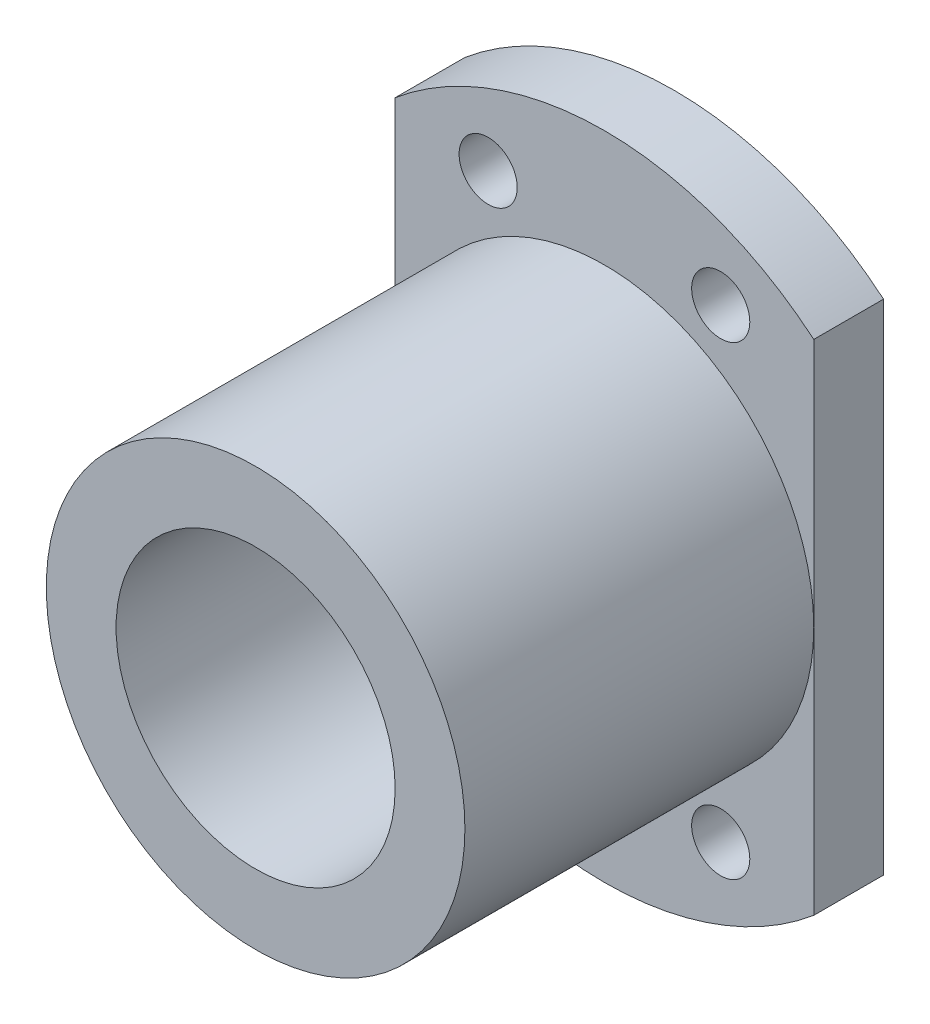
ISO-10303-21;
HEADER;
FILE_DESCRIPTION(('STEP AP214'),'2;1');
FILE_NAME('part.step','',(''),(''),'','','');
FILE_SCHEMA(('AUTOMOTIVE_DESIGN { 1 0 10303 214 1 1 1 1 }'));
ENDSEC;
DATA;
#1=APPLICATION_CONTEXT('core data for automotive mechanical design processes');
#2=APPLICATION_PROTOCOL_DEFINITION('international standard','automotive_design',2000,#1);
#3=PRODUCT_CONTEXT('',#1,'mechanical');
#4=PRODUCT('Part','Part','',(#3));
#5=PRODUCT_RELATED_PRODUCT_CATEGORY('part','',(#4));
#6=PRODUCT_DEFINITION_FORMATION('','',#4);
#7=PRODUCT_DEFINITION_CONTEXT('part definition',#1,'design');
#8=PRODUCT_DEFINITION('design','',#6,#7);
#9=PRODUCT_DEFINITION_SHAPE('','',#8);
#10=(LENGTH_UNIT() NAMED_UNIT(*) SI_UNIT(.MILLI.,.METRE.));
#11=(NAMED_UNIT(*) PLANE_ANGLE_UNIT() SI_UNIT($,.RADIAN.));
#12=(NAMED_UNIT(*) SI_UNIT($,.STERADIAN.) SOLID_ANGLE_UNIT());
#13=UNCERTAINTY_MEASURE_WITH_UNIT(LENGTH_MEASURE(1.E-05),#10,'distance_accuracy_value','');
#14=(GEOMETRIC_REPRESENTATION_CONTEXT(3) GLOBAL_UNCERTAINTY_ASSIGNED_CONTEXT((#13)) GLOBAL_UNIT_ASSIGNED_CONTEXT((#10,
#11,#12)) REPRESENTATION_CONTEXT('',''));
#15=CARTESIAN_POINT('',(0.,0.,0.));
#16=DIRECTION('',(0.,0.,1.));
#17=DIRECTION('',(1.,0.,0.));
#18=AXIS2_PLACEMENT_3D('',#15,#16,#17);
#19=CARTESIAN_POINT('',(0.,0.,3.));
#20=DIRECTION('',(0.,0.,1.));
#21=DIRECTION('',(1.,0.,0.));
#22=AXIS2_PLACEMENT_3D('',#19,#20,#21);
#23=PLANE('',#22);
#24=CARTESIAN_POINT('',(0.,0.,3.));
#25=DIRECTION('',(0.,0.,1.));
#26=DIRECTION('',(1.,0.,0.));
#27=AXIS2_PLACEMENT_3D('',#24,#25,#26);
#28=CIRCLE('',#27,9.);
#29=CARTESIAN_POINT('',(9.,0.,3.));
#30=VERTEX_POINT('',#29);
#31=CARTESIAN_POINT('',(-9.,0.,3.));
#32=VERTEX_POINT('',#31);
#33=EDGE_CURVE('E42',#30,#32,#28,.T.);
#34=ORIENTED_EDGE('',*,*,#33,.F.);
#35=DIRECTION('',(0.,1.,0.));
#36=VECTOR('',#35,1.);
#37=CARTESIAN_POINT('',(9.,10.7238052947636,3.));
#38=LINE('',#37,#36);
#39=CARTESIAN_POINT('',(9.,10.7238052947636,3.));
#40=VERTEX_POINT('',#39);
#41=EDGE_CURVE('E56',#30,#40,#38,.T.);
#42=ORIENTED_EDGE('',*,*,#41,.T.);
#43=CARTESIAN_POINT('',(0.,0.,3.));
#44=DIRECTION('',(0.,0.,1.));
#45=DIRECTION('',(1.,0.,0.));
#46=AXIS2_PLACEMENT_3D('',#43,#44,#45);
#47=CIRCLE('',#46,14.);
#48=CARTESIAN_POINT('',(-9.,10.7238052947636,3.));
#49=VERTEX_POINT('',#48);
#50=EDGE_CURVE('E154',#40,#49,#47,.T.);
#51=ORIENTED_EDGE('',*,*,#50,.T.);
#52=DIRECTION('',(0.,-1.,0.));
#53=VECTOR('',#52,1.);
#54=CARTESIAN_POINT('',(-9.,10.7238052947636,3.));
#55=LINE('',#54,#53);
#56=EDGE_CURVE('E85',#49,#32,#55,.T.);
#57=ORIENTED_EDGE('',*,*,#56,.T.);
#58=EDGE_LOOP('',(#34,#42,#51,#57));
#59=FACE_BOUND('',#58,.T.);
#60=CARTESIAN_POINT('',(5.,10.,3.));
#61=DIRECTION('',(0.,0.,1.));
#62=DIRECTION('',(1.,0.,0.));
#63=AXIS2_PLACEMENT_3D('',#60,#61,#62);
#64=CIRCLE('',#63,1.25);
#65=CARTESIAN_POINT('',(6.25,10.,3.));
#66=VERTEX_POINT('',#65);
#67=EDGE_CURVE('E171',#66,#66,#64,.T.);
#68=ORIENTED_EDGE('',*,*,#67,.F.);
#69=EDGE_LOOP('',(#68));
#70=FACE_BOUND('',#69,.T.);
#71=CARTESIAN_POINT('',(-5.,10.,3.));
#72=DIRECTION('',(0.,0.,1.));
#73=DIRECTION('',(1.,0.,0.));
#74=AXIS2_PLACEMENT_3D('',#71,#72,#73);
#75=CIRCLE('',#74,1.25);
#76=CARTESIAN_POINT('',(-3.75,10.,3.));
#77=VERTEX_POINT('',#76);
#78=EDGE_CURVE('E161',#77,#77,#75,.T.);
#79=ORIENTED_EDGE('',*,*,#78,.F.);
#80=EDGE_LOOP('',(#79));
#81=FACE_BOUND('',#80,.T.);
#82=ADVANCED_FACE('F32',(#59,#70,#81),#23,.T.);
#83=EDGE_CURVE('E11',#32,#30,#28,.T.);
#84=ORIENTED_EDGE('',*,*,#83,.F.);
#85=CARTESIAN_POINT('',(-9.,-10.7238052947636,3.));
#86=VERTEX_POINT('',#85);
#87=EDGE_CURVE('E166',#32,#86,#55,.T.);
#88=ORIENTED_EDGE('',*,*,#87,.T.);
#89=CARTESIAN_POINT('',(0.,0.,3.));
#90=DIRECTION('',(0.,0.,1.));
#91=DIRECTION('',(1.,0.,0.));
#92=AXIS2_PLACEMENT_3D('',#89,#90,#91);
#93=CIRCLE('',#92,14.);
#94=CARTESIAN_POINT('',(9.,-10.7238052947636,3.));
#95=VERTEX_POINT('',#94);
#96=EDGE_CURVE('E92',#86,#95,#93,.T.);
#97=ORIENTED_EDGE('',*,*,#96,.T.);
#98=EDGE_CURVE('E88',#95,#30,#38,.T.);
#99=ORIENTED_EDGE('',*,*,#98,.T.);
#100=EDGE_LOOP('',(#84,#88,#97,#99));
#101=FACE_BOUND('',#100,.T.);
#102=CARTESIAN_POINT('',(-5.,-10.,3.));
#103=DIRECTION('',(0.,0.,1.));
#104=DIRECTION('',(1.,0.,0.));
#105=AXIS2_PLACEMENT_3D('',#102,#103,#104);
#106=CIRCLE('',#105,1.25);
#107=CARTESIAN_POINT('',(-3.75,-10.,3.));
#108=VERTEX_POINT('',#107);
#109=EDGE_CURVE('E177',#108,#108,#106,.T.);
#110=ORIENTED_EDGE('',*,*,#109,.F.);
#111=EDGE_LOOP('',(#110));
#112=FACE_BOUND('',#111,.T.);
#113=CARTESIAN_POINT('',(5.,-10.,3.));
#114=DIRECTION('',(0.,0.,1.));
#115=DIRECTION('',(1.,0.,0.));
#116=AXIS2_PLACEMENT_3D('',#113,#114,#115);
#117=CIRCLE('',#116,1.25);
#118=CARTESIAN_POINT('',(6.25,-10.,3.));
#119=VERTEX_POINT('',#118);
#120=EDGE_CURVE('E183',#119,#119,#117,.T.);
#121=ORIENTED_EDGE('',*,*,#120,.F.);
#122=EDGE_LOOP('',(#121));
#123=FACE_BOUND('',#122,.T.);
#124=ADVANCED_FACE('F89',(#101,#112,#123),#23,.T.);
#125=CARTESIAN_POINT('',(0.,0.,0.));
#126=DIRECTION('',(0.,0.,1.));
#127=DIRECTION('',(1.,0.,0.));
#128=AXIS2_PLACEMENT_3D('',#125,#126,#127);
#129=PLANE('',#128);
#130=CARTESIAN_POINT('',(0.,0.,0.));
#131=DIRECTION('',(0.,0.,1.));
#132=DIRECTION('',(1.,0.,0.));
#133=AXIS2_PLACEMENT_3D('',#130,#131,#132);
#134=CIRCLE('',#133,14.);
#135=CARTESIAN_POINT('',(9.,10.7238052947636,0.));
#136=VERTEX_POINT('',#135);
#137=CARTESIAN_POINT('',(-9.,10.7238052947636,0.));
#138=VERTEX_POINT('',#137);
#139=EDGE_CURVE('E149',#136,#138,#134,.T.);
#140=ORIENTED_EDGE('',*,*,#139,.F.);
#141=DIRECTION('',(0.,1.,0.));
#142=VECTOR('',#141,1.);
#143=CARTESIAN_POINT('',(9.,10.7238052947636,0.));
#144=LINE('',#143,#142);
#145=CARTESIAN_POINT('',(9.,-10.7238052947636,0.));
#146=VERTEX_POINT('',#145);
#147=EDGE_CURVE('E78',#146,#136,#144,.T.);
#148=ORIENTED_EDGE('',*,*,#147,.F.);
#149=CARTESIAN_POINT('',(0.,0.,0.));
#150=DIRECTION('',(0.,0.,1.));
#151=DIRECTION('',(1.,0.,0.));
#152=AXIS2_PLACEMENT_3D('',#149,#150,#151);
#153=CIRCLE('',#152,14.);
#154=CARTESIAN_POINT('',(-9.,-10.7238052947636,0.));
#155=VERTEX_POINT('',#154);
#156=EDGE_CURVE('E148',#155,#146,#153,.T.);
#157=ORIENTED_EDGE('',*,*,#156,.F.);
#158=DIRECTION('',(0.,-1.,0.));
#159=VECTOR('',#158,1.);
#160=CARTESIAN_POINT('',(-9.,10.7238052947636,0.));
#161=LINE('',#160,#159);
#162=EDGE_CURVE('E141',#138,#155,#161,.T.);
#163=ORIENTED_EDGE('',*,*,#162,.F.);
#164=EDGE_LOOP('',(#140,#148,#157,#163));
#165=FACE_BOUND('',#164,.T.);
#166=CARTESIAN_POINT('',(0.,0.,0.));
#167=DIRECTION('',(0.,0.,1.));
#168=DIRECTION('',(1.,0.,0.));
#169=AXIS2_PLACEMENT_3D('',#166,#167,#168);
#170=CIRCLE('',#169,6.);
#171=CARTESIAN_POINT('',(6.,0.,0.));
#172=VERTEX_POINT('',#171);
#173=EDGE_CURVE('E159',#172,#172,#170,.T.);
#174=ORIENTED_EDGE('',*,*,#173,.T.);
#175=EDGE_LOOP('',(#174));
#176=FACE_BOUND('',#175,.T.);
#177=CARTESIAN_POINT('',(-5.,10.,0.));
#178=DIRECTION('',(0.,0.,1.));
#179=DIRECTION('',(1.,0.,0.));
#180=AXIS2_PLACEMENT_3D('',#177,#178,#179);
#181=CIRCLE('',#180,1.25);
#182=CARTESIAN_POINT('',(-3.75,10.,0.));
#183=VERTEX_POINT('',#182);
#184=EDGE_CURVE('E168',#183,#183,#181,.T.);
#185=ORIENTED_EDGE('',*,*,#184,.T.);
#186=EDGE_LOOP('',(#185));
#187=FACE_BOUND('',#186,.T.);
#188=CARTESIAN_POINT('',(5.,10.,0.));
#189=DIRECTION('',(0.,0.,1.));
#190=DIRECTION('',(1.,0.,0.));
#191=AXIS2_PLACEMENT_3D('',#188,#189,#190);
#192=CIRCLE('',#191,1.25);
#193=CARTESIAN_POINT('',(6.25,10.,0.));
#194=VERTEX_POINT('',#193);
#195=EDGE_CURVE('E174',#194,#194,#192,.T.);
#196=ORIENTED_EDGE('',*,*,#195,.T.);
#197=EDGE_LOOP('',(#196));
#198=FACE_BOUND('',#197,.T.);
#199=CARTESIAN_POINT('',(-5.,-10.,0.));
#200=DIRECTION('',(0.,0.,1.));
#201=DIRECTION('',(1.,0.,0.));
#202=AXIS2_PLACEMENT_3D('',#199,#200,#201);
#203=CIRCLE('',#202,1.25);
#204=CARTESIAN_POINT('',(-3.75,-10.,0.));
#205=VERTEX_POINT('',#204);
#206=EDGE_CURVE('E180',#205,#205,#203,.T.);
#207=ORIENTED_EDGE('',*,*,#206,.T.);
#208=EDGE_LOOP('',(#207));
#209=FACE_BOUND('',#208,.T.);
#210=CARTESIAN_POINT('',(5.,-10.,0.));
#211=DIRECTION('',(0.,0.,1.));
#212=DIRECTION('',(1.,0.,0.));
#213=AXIS2_PLACEMENT_3D('',#210,#211,#212);
#214=CIRCLE('',#213,1.25);
#215=CARTESIAN_POINT('',(6.25,-10.,0.));
#216=VERTEX_POINT('',#215);
#217=EDGE_CURVE('E186',#216,#216,#214,.T.);
#218=ORIENTED_EDGE('',*,*,#217,.T.);
#219=EDGE_LOOP('',(#218));
#220=FACE_BOUND('',#219,.T.);
#221=ADVANCED_FACE('F121',(#165,#176,#187,#198,#209,#220),#129,.F.);
#222=CARTESIAN_POINT('',(0.,0.,3.));
#223=DIRECTION('',(0.,0.,-1.));
#224=DIRECTION('',(-1.,0.,0.));
#225=AXIS2_PLACEMENT_3D('',#222,#223,#224);
#226=CYLINDRICAL_SURFACE('',#225,14.);
#227=ORIENTED_EDGE('',*,*,#139,.T.);
#228=DIRECTION('',(0.,0.,-1.));
#229=VECTOR('',#228,1.);
#230=CARTESIAN_POINT('',(-9.,10.7238052947636,3.));
#231=LINE('',#230,#229);
#232=EDGE_CURVE('E36',#49,#138,#231,.T.);
#233=ORIENTED_EDGE('',*,*,#232,.F.);
#234=ORIENTED_EDGE('',*,*,#50,.F.);
#235=DIRECTION('',(0.,0.,-1.));
#236=VECTOR('',#235,1.);
#237=CARTESIAN_POINT('',(9.,10.7238052947636,3.));
#238=LINE('',#237,#236);
#239=EDGE_CURVE('E94',#40,#136,#238,.T.);
#240=ORIENTED_EDGE('',*,*,#239,.T.);
#241=EDGE_LOOP('',(#227,#233,#234,#240));
#242=FACE_BOUND('',#241,.T.);
#243=ADVANCED_FACE('F34',(#242),#226,.T.);
#244=CARTESIAN_POINT('',(-9.,10.7238052947636,3.));
#245=DIRECTION('',(1.,0.,0.));
#246=DIRECTION('',(0.,0.,-1.));
#247=AXIS2_PLACEMENT_3D('',#244,#245,#246);
#248=PLANE('',#247);
#249=ORIENTED_EDGE('',*,*,#162,.T.);
#250=DIRECTION('',(0.,0.,-1.));
#251=VECTOR('',#250,1.);
#252=CARTESIAN_POINT('',(-9.,-10.7238052947636,3.));
#253=LINE('',#252,#251);
#254=EDGE_CURVE('E143',#86,#155,#253,.T.);
#255=ORIENTED_EDGE('',*,*,#254,.F.);
#256=ORIENTED_EDGE('',*,*,#87,.F.);
#257=ORIENTED_EDGE('',*,*,#56,.F.);
#258=ORIENTED_EDGE('',*,*,#232,.T.);
#259=EDGE_LOOP('',(#249,#255,#256,#257,#258));
#260=FACE_BOUND('',#259,.T.);
#261=ADVANCED_FACE('F133',(#260),#248,.F.);
#262=CARTESIAN_POINT('',(0.,0.,3.));
#263=DIRECTION('',(0.,0.,-1.));
#264=DIRECTION('',(-1.,0.,0.));
#265=AXIS2_PLACEMENT_3D('',#262,#263,#264);
#266=CYLINDRICAL_SURFACE('',#265,14.);
#267=ORIENTED_EDGE('',*,*,#156,.T.);
#268=DIRECTION('',(0.,0.,-1.));
#269=VECTOR('',#268,1.);
#270=CARTESIAN_POINT('',(9.,-10.7238052947636,3.));
#271=LINE('',#270,#269);
#272=EDGE_CURVE('E151',#95,#146,#271,.T.);
#273=ORIENTED_EDGE('',*,*,#272,.F.);
#274=ORIENTED_EDGE('',*,*,#96,.F.);
#275=ORIENTED_EDGE('',*,*,#254,.T.);
#276=EDGE_LOOP('',(#267,#273,#274,#275));
#277=FACE_BOUND('',#276,.T.);
#278=ADVANCED_FACE('F131',(#277),#266,.T.);
#279=CARTESIAN_POINT('',(9.,10.7238052947636,3.));
#280=DIRECTION('',(-1.,0.,0.));
#281=DIRECTION('',(0.,0.,1.));
#282=AXIS2_PLACEMENT_3D('',#279,#280,#281);
#283=PLANE('',#282);
#284=ORIENTED_EDGE('',*,*,#147,.T.);
#285=ORIENTED_EDGE('',*,*,#239,.F.);
#286=ORIENTED_EDGE('',*,*,#41,.F.);
#287=ORIENTED_EDGE('',*,*,#98,.F.);
#288=ORIENTED_EDGE('',*,*,#272,.T.);
#289=EDGE_LOOP('',(#284,#285,#286,#287,#288));
#290=FACE_BOUND('',#289,.T.);
#291=ADVANCED_FACE('F96',(#290),#283,.F.);
#292=CARTESIAN_POINT('',(0.,0.,3.));
#293=DIRECTION('',(0.,0.,-1.));
#294=DIRECTION('',(-1.,0.,0.));
#295=AXIS2_PLACEMENT_3D('',#292,#293,#294);
#296=CYLINDRICAL_SURFACE('',#295,6.);
#297=ORIENTED_EDGE('',*,*,#173,.F.);
#298=EDGE_LOOP('',(#297));
#299=FACE_BOUND('',#298,.T.);
#300=CARTESIAN_POINT('',(0.,0.,18.));
#301=DIRECTION('',(0.,0.,1.));
#302=DIRECTION('',(1.,0.,0.));
#303=AXIS2_PLACEMENT_3D('',#300,#301,#302);
#304=CIRCLE('',#303,6.);
#305=CARTESIAN_POINT('',(6.,0.,18.));
#306=VERTEX_POINT('',#305);
#307=EDGE_CURVE('E102',#306,#306,#304,.T.);
#308=ORIENTED_EDGE('',*,*,#307,.T.);
#309=EDGE_LOOP('',(#308));
#310=FACE_BOUND('',#309,.T.);
#311=ADVANCED_FACE('F124',(#299,#310),#296,.F.);
#312=CARTESIAN_POINT('',(-5.,10.,3.));
#313=DIRECTION('',(0.,0.,-1.));
#314=DIRECTION('',(-1.,0.,0.));
#315=AXIS2_PLACEMENT_3D('',#312,#313,#314);
#316=CYLINDRICAL_SURFACE('',#315,1.25);
#317=ORIENTED_EDGE('',*,*,#78,.T.);
#318=EDGE_LOOP('',(#317));
#319=FACE_BOUND('',#318,.T.);
#320=ORIENTED_EDGE('',*,*,#184,.F.);
#321=EDGE_LOOP('',(#320));
#322=FACE_BOUND('',#321,.T.);
#323=ADVANCED_FACE('F198',(#319,#322),#316,.F.);
#324=CARTESIAN_POINT('',(5.,10.,3.));
#325=DIRECTION('',(0.,0.,-1.));
#326=DIRECTION('',(-1.,0.,0.));
#327=AXIS2_PLACEMENT_3D('',#324,#325,#326);
#328=CYLINDRICAL_SURFACE('',#327,1.25);
#329=ORIENTED_EDGE('',*,*,#67,.T.);
#330=EDGE_LOOP('',(#329));
#331=FACE_BOUND('',#330,.T.);
#332=ORIENTED_EDGE('',*,*,#195,.F.);
#333=EDGE_LOOP('',(#332));
#334=FACE_BOUND('',#333,.T.);
#335=ADVANCED_FACE('F203',(#331,#334),#328,.F.);
#336=CARTESIAN_POINT('',(-5.,-10.,3.));
#337=DIRECTION('',(0.,0.,-1.));
#338=DIRECTION('',(-1.,0.,0.));
#339=AXIS2_PLACEMENT_3D('',#336,#337,#338);
#340=CYLINDRICAL_SURFACE('',#339,1.25);
#341=ORIENTED_EDGE('',*,*,#109,.T.);
#342=EDGE_LOOP('',(#341));
#343=FACE_BOUND('',#342,.T.);
#344=ORIENTED_EDGE('',*,*,#206,.F.);
#345=EDGE_LOOP('',(#344));
#346=FACE_BOUND('',#345,.T.);
#347=ADVANCED_FACE('F216',(#343,#346),#340,.F.);
#348=CARTESIAN_POINT('',(5.,-10.,3.));
#349=DIRECTION('',(0.,0.,-1.));
#350=DIRECTION('',(-1.,0.,0.));
#351=AXIS2_PLACEMENT_3D('',#348,#349,#350);
#352=CYLINDRICAL_SURFACE('',#351,1.25);
#353=ORIENTED_EDGE('',*,*,#120,.T.);
#354=EDGE_LOOP('',(#353));
#355=FACE_BOUND('',#354,.T.);
#356=ORIENTED_EDGE('',*,*,#217,.F.);
#357=EDGE_LOOP('',(#356));
#358=FACE_BOUND('',#357,.T.);
#359=ADVANCED_FACE('F111',(#355,#358),#352,.F.);
#360=CARTESIAN_POINT('',(0.,0.,18.));
#361=DIRECTION('',(0.,0.,1.));
#362=DIRECTION('',(1.,0.,0.));
#363=AXIS2_PLACEMENT_3D('',#360,#361,#362);
#364=PLANE('',#363);
#365=CARTESIAN_POINT('',(0.,0.,18.));
#366=DIRECTION('',(0.,0.,1.));
#367=DIRECTION('',(1.,0.,0.));
#368=AXIS2_PLACEMENT_3D('',#365,#366,#367);
#369=CIRCLE('',#368,9.);
#370=CARTESIAN_POINT('',(9.,0.,18.));
#371=VERTEX_POINT('',#370);
#372=EDGE_CURVE('E101',#371,#371,#369,.T.);
#373=ORIENTED_EDGE('',*,*,#372,.T.);
#374=EDGE_LOOP('',(#373));
#375=FACE_BOUND('',#374,.T.);
#376=ORIENTED_EDGE('',*,*,#307,.F.);
#377=EDGE_LOOP('',(#376));
#378=FACE_BOUND('',#377,.T.);
#379=ADVANCED_FACE('F105',(#375,#378),#364,.T.);
#380=CARTESIAN_POINT('',(0.,0.,18.));
#381=DIRECTION('',(0.,0.,-1.));
#382=DIRECTION('',(-1.,0.,0.));
#383=AXIS2_PLACEMENT_3D('',#380,#381,#382);
#384=CYLINDRICAL_SURFACE('',#383,9.);
#385=ORIENTED_EDGE('',*,*,#372,.F.);
#386=EDGE_LOOP('',(#385));
#387=FACE_BOUND('',#386,.T.);
#388=ORIENTED_EDGE('',*,*,#33,.T.);
#389=ORIENTED_EDGE('',*,*,#83,.T.);
#390=EDGE_LOOP('',(#388,#389));
#391=FACE_BOUND('',#390,.T.);
#392=ADVANCED_FACE('F103',(#387,#391),#384,.T.);
#393=CLOSED_SHELL('',(#82,#124,#221,#243,#261,#278,#291,#311,#323,#335,#347,#359,#379,#392));
#394=MANIFOLD_SOLID_BREP('B2',#393);
#395=ADVANCED_BREP_SHAPE_REPRESENTATION('',(#18,#394),#14);
#396=SHAPE_DEFINITION_REPRESENTATION(#9,#395);
ENDSEC;
END-ISO-10303-21;
